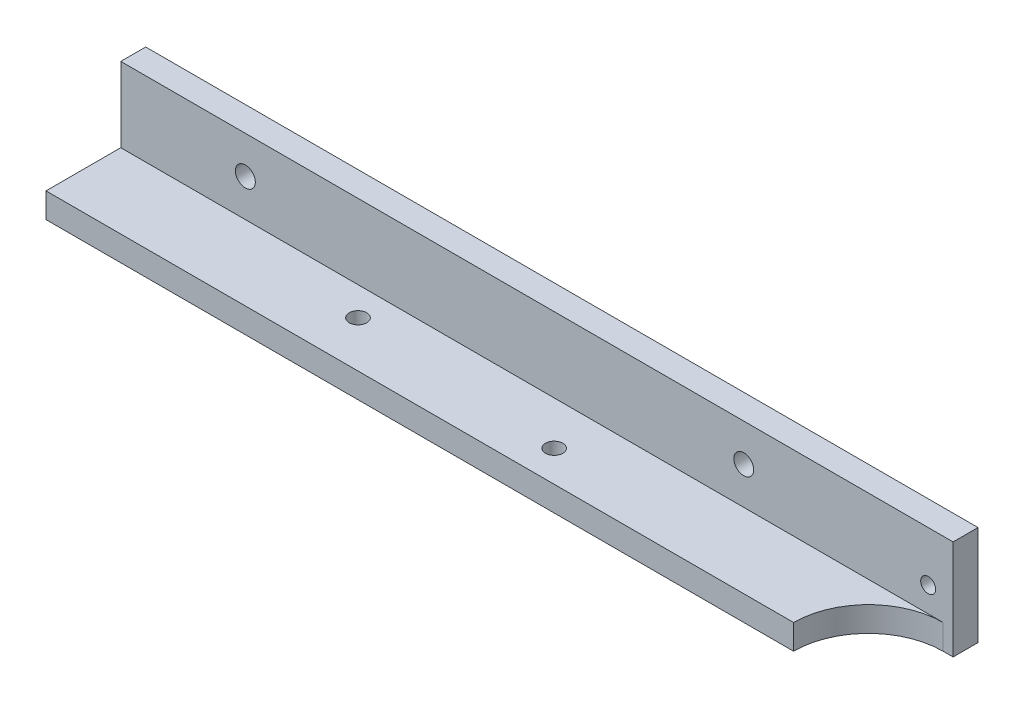
ISO-10303-21;
HEADER;
FILE_DESCRIPTION(('STEP AP214'),'2;1');
FILE_NAME('part.step','',(''),(''),'','','');
FILE_SCHEMA(('AUTOMOTIVE_DESIGN { 1 0 10303 214 1 1 1 1 }'));
ENDSEC;
DATA;
#1=APPLICATION_CONTEXT('core data for automotive mechanical design processes');
#2=APPLICATION_PROTOCOL_DEFINITION('international standard','automotive_design',2000,#1);
#3=PRODUCT_CONTEXT('',#1,'mechanical');
#4=PRODUCT('Part','Part','',(#3));
#5=PRODUCT_RELATED_PRODUCT_CATEGORY('part','',(#4));
#6=PRODUCT_DEFINITION_FORMATION('','',#4);
#7=PRODUCT_DEFINITION_CONTEXT('part definition',#1,'design');
#8=PRODUCT_DEFINITION('design','',#6,#7);
#9=PRODUCT_DEFINITION_SHAPE('','',#8);
#10=(LENGTH_UNIT() NAMED_UNIT(*) SI_UNIT(.MILLI.,.METRE.));
#11=(NAMED_UNIT(*) PLANE_ANGLE_UNIT() SI_UNIT($,.RADIAN.));
#12=(NAMED_UNIT(*) SI_UNIT($,.STERADIAN.) SOLID_ANGLE_UNIT());
#13=UNCERTAINTY_MEASURE_WITH_UNIT(LENGTH_MEASURE(1.E-05),#10,'distance_accuracy_value','');
#14=(GEOMETRIC_REPRESENTATION_CONTEXT(3) GLOBAL_UNCERTAINTY_ASSIGNED_CONTEXT((#13)) GLOBAL_UNIT_ASSIGNED_CONTEXT((#10,
#11,#12)) REPRESENTATION_CONTEXT('',''));
#15=CARTESIAN_POINT('',(0.,0.,0.));
#16=DIRECTION('',(0.,0.,1.));
#17=DIRECTION('',(1.,0.,0.));
#18=AXIS2_PLACEMENT_3D('',#15,#16,#17);
#19=CARTESIAN_POINT('',(0.,0.,0.));
#20=DIRECTION('',(0.,-1.,0.));
#21=DIRECTION('',(0.,0.,-1.));
#22=AXIS2_PLACEMENT_3D('',#19,#20,#21);
#23=PLANE('',#22);
#24=CARTESIAN_POINT('',(53.35,0.,-9.25));
#25=DIRECTION('',(0.,1.,0.));
#26=DIRECTION('',(0.,0.,1.));
#27=AXIS2_PLACEMENT_3D('',#24,#25,#26);
#28=CIRCLE('',#27,1.75);
#29=CARTESIAN_POINT('',(53.35,0.,-7.5));
#30=VERTEX_POINT('',#29);
#31=EDGE_CURVE('E133',#30,#30,#28,.T.);
#32=ORIENTED_EDGE('',*,*,#31,.F.);
#33=EDGE_LOOP('',(#32));
#34=FACE_BOUND('',#33,.T.);
#35=CARTESIAN_POINT('',(95.7,0.,-6.25));
#36=DIRECTION('',(0.,1.,0.));
#37=DIRECTION('',(0.,0.,1.));
#38=AXIS2_PLACEMENT_3D('',#35,#36,#37);
#39=CIRCLE('',#38,1.75);
#40=CARTESIAN_POINT('',(95.7,0.,-4.5));
#41=VERTEX_POINT('',#40);
#42=EDGE_CURVE('E121',#41,#41,#39,.T.);
#43=ORIENTED_EDGE('',*,*,#42,.F.);
#44=EDGE_LOOP('',(#43));
#45=FACE_BOUND('',#44,.T.);
#46=DIRECTION('',(1.,0.,0.));
#47=VECTOR('',#46,1.);
#48=CARTESIAN_POINT('',(0.,0.,-15.));
#49=LINE('',#48,#47);
#50=CARTESIAN_POINT('',(0.,0.,-15.));
#51=VERTEX_POINT('',#50);
#52=CARTESIAN_POINT('',(165.,0.,-15.));
#53=VERTEX_POINT('',#52);
#54=EDGE_CURVE('E55',#51,#53,#49,.T.);
#55=ORIENTED_EDGE('',*,*,#54,.F.);
#56=DIRECTION('',(0.,0.,1.));
#57=VECTOR('',#56,1.);
#58=CARTESIAN_POINT('',(0.,0.,0.));
#59=LINE('',#58,#57);
#60=CARTESIAN_POINT('',(0.,0.,0.));
#61=VERTEX_POINT('',#60);
#62=EDGE_CURVE('E160',#51,#61,#59,.T.);
#63=ORIENTED_EDGE('',*,*,#62,.T.);
#64=DIRECTION('',(1.,0.,0.));
#65=VECTOR('',#64,1.);
#66=CARTESIAN_POINT('',(0.,0.,0.));
#67=LINE('',#66,#65);
#68=CARTESIAN_POINT('',(150.,0.,0.));
#69=VERTEX_POINT('',#68);
#70=EDGE_CURVE('E165',#61,#69,#67,.T.);
#71=ORIENTED_EDGE('',*,*,#70,.T.);
#72=CARTESIAN_POINT('',(165.,0.,0.));
#73=DIRECTION('',(0.,-1.,0.));
#74=DIRECTION('',(0.,0.,-1.));
#75=AXIS2_PLACEMENT_3D('',#72,#73,#74);
#76=CIRCLE('',#75,15.);
#77=EDGE_CURVE('E11',#69,#53,#76,.T.);
#78=ORIENTED_EDGE('',*,*,#77,.T.);
#79=EDGE_LOOP('',(#55,#63,#71,#78));
#80=FACE_BOUND('',#79,.T.);
#81=ADVANCED_FACE('F40',(#34,#45,#80),#23,.F.);
#82=CARTESIAN_POINT('',(0.,-5.,0.));
#83=DIRECTION('',(-1.,0.,0.));
#84=DIRECTION('',(0.,0.,1.));
#85=AXIS2_PLACEMENT_3D('',#82,#83,#84);
#86=PLANE('',#85);
#87=ORIENTED_EDGE('',*,*,#62,.F.);
#88=DIRECTION('',(0.,-1.,0.));
#89=VECTOR('',#88,1.);
#90=CARTESIAN_POINT('',(0.,15.,-15.));
#91=LINE('',#90,#89);
#92=CARTESIAN_POINT('',(0.,15.,-15.));
#93=VERTEX_POINT('',#92);
#94=EDGE_CURVE('E157',#93,#51,#91,.T.);
#95=ORIENTED_EDGE('',*,*,#94,.F.);
#96=DIRECTION('',(0.,0.,1.));
#97=VECTOR('',#96,1.);
#98=CARTESIAN_POINT('',(0.,15.,-20.));
#99=LINE('',#98,#97);
#100=CARTESIAN_POINT('',(0.,15.,-20.));
#101=VERTEX_POINT('',#100);
#102=EDGE_CURVE('E149',#101,#93,#99,.T.);
#103=ORIENTED_EDGE('',*,*,#102,.F.);
#104=DIRECTION('',(0.,1.,0.));
#105=VECTOR('',#104,1.);
#106=CARTESIAN_POINT('',(0.,-5.,-20.));
#107=LINE('',#106,#105);
#108=CARTESIAN_POINT('',(0.,-5.,-20.));
#109=VERTEX_POINT('',#108);
#110=EDGE_CURVE('E173',#109,#101,#107,.T.);
#111=ORIENTED_EDGE('',*,*,#110,.F.);
#112=DIRECTION('',(0.,0.,1.));
#113=VECTOR('',#112,1.);
#114=CARTESIAN_POINT('',(0.,-5.,0.));
#115=LINE('',#114,#113);
#116=CARTESIAN_POINT('',(0.,-5.,0.));
#117=VERTEX_POINT('',#116);
#118=EDGE_CURVE('E161',#109,#117,#115,.T.);
#119=ORIENTED_EDGE('',*,*,#118,.T.);
#120=DIRECTION('',(0.,1.,0.));
#121=VECTOR('',#120,1.);
#122=CARTESIAN_POINT('',(0.,-5.,0.));
#123=LINE('',#122,#121);
#124=EDGE_CURVE('E169',#117,#61,#123,.T.);
#125=ORIENTED_EDGE('',*,*,#124,.T.);
#126=EDGE_LOOP('',(#87,#95,#103,#111,#119,#125));
#127=FACE_BOUND('',#126,.T.);
#128=ADVANCED_FACE('F188',(#127),#86,.T.);
#129=CARTESIAN_POINT('',(0.,-5.,-20.));
#130=DIRECTION('',(0.,0.,-1.));
#131=DIRECTION('',(-1.,0.,0.));
#132=AXIS2_PLACEMENT_3D('',#129,#130,#131);
#133=PLANE('',#132);
#134=CARTESIAN_POINT('',(162.,5.,-20.));
#135=DIRECTION('',(0.,0.,1.));
#136=DIRECTION('',(1.,0.,0.));
#137=AXIS2_PLACEMENT_3D('',#134,#135,#136);
#138=CIRCLE('',#137,1.5);
#139=CARTESIAN_POINT('',(163.5,5.,-20.));
#140=VERTEX_POINT('',#139);
#141=EDGE_CURVE('E117',#140,#140,#138,.T.);
#142=ORIENTED_EDGE('',*,*,#141,.T.);
#143=EDGE_LOOP('',(#142));
#144=FACE_BOUND('',#143,.T.);
#145=CARTESIAN_POINT('',(25.,7.5,-20.));
#146=DIRECTION('',(0.,0.,1.));
#147=DIRECTION('',(1.,0.,0.));
#148=AXIS2_PLACEMENT_3D('',#145,#146,#147);
#149=CIRCLE('',#148,2.);
#150=CARTESIAN_POINT('',(27.,7.5,-20.));
#151=VERTEX_POINT('',#150);
#152=EDGE_CURVE('E138',#151,#151,#149,.T.);
#153=ORIENTED_EDGE('',*,*,#152,.T.);
#154=EDGE_LOOP('',(#153));
#155=FACE_BOUND('',#154,.T.);
#156=CARTESIAN_POINT('',(125.,7.5,-20.));
#157=DIRECTION('',(0.,0.,1.));
#158=DIRECTION('',(1.,0.,0.));
#159=AXIS2_PLACEMENT_3D('',#156,#157,#158);
#160=CIRCLE('',#159,2.);
#161=CARTESIAN_POINT('',(127.,7.5,-20.));
#162=VERTEX_POINT('',#161);
#163=EDGE_CURVE('E144',#162,#162,#160,.T.);
#164=ORIENTED_EDGE('',*,*,#163,.T.);
#165=EDGE_LOOP('',(#164));
#166=FACE_BOUND('',#165,.T.);
#167=ORIENTED_EDGE('',*,*,#110,.T.);
#168=DIRECTION('',(-1.,0.,0.));
#169=VECTOR('',#168,1.);
#170=CARTESIAN_POINT('',(0.,15.,-20.));
#171=LINE('',#170,#169);
#172=CARTESIAN_POINT('',(167.,15.,-20.));
#173=VERTEX_POINT('',#172);
#174=EDGE_CURVE('E154',#173,#101,#171,.T.);
#175=ORIENTED_EDGE('',*,*,#174,.F.);
#176=DIRECTION('',(0.,1.,0.));
#177=VECTOR('',#176,1.);
#178=CARTESIAN_POINT('',(167.,15.,-20.));
#179=LINE('',#178,#177);
#180=CARTESIAN_POINT('',(167.,-5.,-20.));
#181=VERTEX_POINT('',#180);
#182=EDGE_CURVE('E109',#181,#173,#179,.T.);
#183=ORIENTED_EDGE('',*,*,#182,.F.);
#184=DIRECTION('',(-1.,0.,0.));
#185=VECTOR('',#184,1.);
#186=CARTESIAN_POINT('',(0.,-5.,-20.));
#187=LINE('',#186,#185);
#188=EDGE_CURVE('E105',#181,#109,#187,.T.);
#189=ORIENTED_EDGE('',*,*,#188,.T.);
#190=EDGE_LOOP('',(#167,#175,#183,#189));
#191=FACE_BOUND('',#190,.T.);
#192=ADVANCED_FACE('F191',(#144,#155,#166,#191),#133,.T.);
#193=CARTESIAN_POINT('',(0.,-5.,0.));
#194=DIRECTION('',(0.,0.,1.));
#195=DIRECTION('',(1.,0.,0.));
#196=AXIS2_PLACEMENT_3D('',#193,#194,#195);
#197=PLANE('',#196);
#198=ORIENTED_EDGE('',*,*,#70,.F.);
#199=ORIENTED_EDGE('',*,*,#124,.F.);
#200=DIRECTION('',(1.,0.,0.));
#201=VECTOR('',#200,1.);
#202=CARTESIAN_POINT('',(0.,-5.,0.));
#203=LINE('',#202,#201);
#204=CARTESIAN_POINT('',(150.,-5.,0.));
#205=VERTEX_POINT('',#204);
#206=EDGE_CURVE('E164',#117,#205,#203,.T.);
#207=ORIENTED_EDGE('',*,*,#206,.T.);
#208=DIRECTION('',(0.,1.,0.));
#209=VECTOR('',#208,1.);
#210=CARTESIAN_POINT('',(150.,-5.,0.));
#211=LINE('',#210,#209);
#212=EDGE_CURVE('E175',#205,#69,#211,.T.);
#213=ORIENTED_EDGE('',*,*,#212,.T.);
#214=EDGE_LOOP('',(#198,#199,#207,#213));
#215=FACE_BOUND('',#214,.T.);
#216=ADVANCED_FACE('F182',(#215),#197,.T.);
#217=CARTESIAN_POINT('',(0.,-5.,0.));
#218=DIRECTION('',(0.,-1.,0.));
#219=DIRECTION('',(0.,0.,-1.));
#220=AXIS2_PLACEMENT_3D('',#217,#218,#219);
#221=PLANE('',#220);
#222=CARTESIAN_POINT('',(53.35,-5.,-9.25));
#223=DIRECTION('',(0.,1.,0.));
#224=DIRECTION('',(0.,0.,1.));
#225=AXIS2_PLACEMENT_3D('',#222,#223,#224);
#226=CIRCLE('',#225,1.75);
#227=CARTESIAN_POINT('',(53.35,-5.,-7.5));
#228=VERTEX_POINT('',#227);
#229=EDGE_CURVE('E129',#228,#228,#226,.T.);
#230=ORIENTED_EDGE('',*,*,#229,.T.);
#231=EDGE_LOOP('',(#230));
#232=FACE_BOUND('',#231,.T.);
#233=CARTESIAN_POINT('',(95.7,-5.,-6.25));
#234=DIRECTION('',(0.,1.,0.));
#235=DIRECTION('',(0.,0.,1.));
#236=AXIS2_PLACEMENT_3D('',#233,#234,#235);
#237=CIRCLE('',#236,1.75);
#238=CARTESIAN_POINT('',(95.7,-5.,-4.5));
#239=VERTEX_POINT('',#238);
#240=EDGE_CURVE('E124',#239,#239,#237,.T.);
#241=ORIENTED_EDGE('',*,*,#240,.T.);
#242=EDGE_LOOP('',(#241));
#243=FACE_BOUND('',#242,.T.);
#244=ORIENTED_EDGE('',*,*,#118,.F.);
#245=ORIENTED_EDGE('',*,*,#188,.F.);
#246=DIRECTION('',(0.,0.,-1.));
#247=VECTOR('',#246,1.);
#248=CARTESIAN_POINT('',(167.,-5.,-15.));
#249=LINE('',#248,#247);
#250=CARTESIAN_POINT('',(167.,-5.,-15.));
#251=VERTEX_POINT('',#250);
#252=EDGE_CURVE('E98',#251,#181,#249,.T.);
#253=ORIENTED_EDGE('',*,*,#252,.F.);
#254=DIRECTION('',(-1.,0.,0.));
#255=VECTOR('',#254,1.);
#256=CARTESIAN_POINT('',(167.,-5.,-15.));
#257=LINE('',#256,#255);
#258=CARTESIAN_POINT('',(165.,-5.,-15.));
#259=VERTEX_POINT('',#258);
#260=EDGE_CURVE('E103',#251,#259,#257,.T.);
#261=ORIENTED_EDGE('',*,*,#260,.T.);
#262=CARTESIAN_POINT('',(165.,-5.,0.));
#263=DIRECTION('',(0.,-1.,0.));
#264=DIRECTION('',(0.,0.,-1.));
#265=AXIS2_PLACEMENT_3D('',#262,#263,#264);
#266=CIRCLE('',#265,15.);
#267=EDGE_CURVE('E48',#259,#205,#266,.F.);
#268=ORIENTED_EDGE('',*,*,#267,.T.);
#269=ORIENTED_EDGE('',*,*,#206,.F.);
#270=EDGE_LOOP('',(#244,#245,#253,#261,#268,#269));
#271=FACE_BOUND('',#270,.T.);
#272=ADVANCED_FACE('F101',(#232,#243,#271),#221,.T.);
#273=CARTESIAN_POINT('',(0.,15.,-15.));
#274=DIRECTION('',(0.,0.,-1.));
#275=DIRECTION('',(-1.,0.,0.));
#276=AXIS2_PLACEMENT_3D('',#273,#274,#275);
#277=PLANE('',#276);
#278=CARTESIAN_POINT('',(162.,5.,-15.));
#279=DIRECTION('',(0.,0.,1.));
#280=DIRECTION('',(1.,0.,0.));
#281=AXIS2_PLACEMENT_3D('',#278,#279,#280);
#282=CIRCLE('',#281,1.5);
#283=CARTESIAN_POINT('',(163.5,5.,-15.));
#284=VERTEX_POINT('',#283);
#285=EDGE_CURVE('E193',#284,#284,#282,.T.);
#286=ORIENTED_EDGE('',*,*,#285,.F.);
#287=EDGE_LOOP('',(#286));
#288=FACE_BOUND('',#287,.T.);
#289=CARTESIAN_POINT('',(25.,7.5,-15.));
#290=DIRECTION('',(0.,0.,1.));
#291=DIRECTION('',(1.,0.,0.));
#292=AXIS2_PLACEMENT_3D('',#289,#290,#291);
#293=CIRCLE('',#292,2.);
#294=CARTESIAN_POINT('',(27.,7.5,-15.));
#295=VERTEX_POINT('',#294);
#296=EDGE_CURVE('E141',#295,#295,#293,.T.);
#297=ORIENTED_EDGE('',*,*,#296,.F.);
#298=EDGE_LOOP('',(#297));
#299=FACE_BOUND('',#298,.T.);
#300=CARTESIAN_POINT('',(125.,7.5,-15.));
#301=DIRECTION('',(0.,0.,1.));
#302=DIRECTION('',(1.,0.,0.));
#303=AXIS2_PLACEMENT_3D('',#300,#301,#302);
#304=CIRCLE('',#303,2.);
#305=CARTESIAN_POINT('',(127.,7.5,-15.));
#306=VERTEX_POINT('',#305);
#307=EDGE_CURVE('E132',#306,#306,#304,.T.);
#308=ORIENTED_EDGE('',*,*,#307,.F.);
#309=EDGE_LOOP('',(#308));
#310=FACE_BOUND('',#309,.T.);
#311=ORIENTED_EDGE('',*,*,#54,.T.);
#312=DIRECTION('',(0.,-1.,0.));
#313=VECTOR('',#312,1.);
#314=CARTESIAN_POINT('',(165.,15.,-15.));
#315=LINE('',#314,#313);
#316=EDGE_CURVE('E120',#53,#259,#315,.T.);
#317=ORIENTED_EDGE('',*,*,#316,.T.);
#318=ORIENTED_EDGE('',*,*,#260,.F.);
#319=DIRECTION('',(0.,-1.,0.));
#320=VECTOR('',#319,1.);
#321=CARTESIAN_POINT('',(167.,15.,-15.));
#322=LINE('',#321,#320);
#323=CARTESIAN_POINT('',(167.,15.,-15.));
#324=VERTEX_POINT('',#323);
#325=EDGE_CURVE('E110',#324,#251,#322,.T.);
#326=ORIENTED_EDGE('',*,*,#325,.F.);
#327=DIRECTION('',(1.,0.,0.));
#328=VECTOR('',#327,1.);
#329=CARTESIAN_POINT('',(0.,15.,-15.));
#330=LINE('',#329,#328);
#331=EDGE_CURVE('E152',#93,#324,#330,.T.);
#332=ORIENTED_EDGE('',*,*,#331,.F.);
#333=ORIENTED_EDGE('',*,*,#94,.T.);
#334=EDGE_LOOP('',(#311,#317,#318,#326,#332,#333));
#335=FACE_BOUND('',#334,.T.);
#336=ADVANCED_FACE('F119',(#288,#299,#310,#335),#277,.F.);
#337=CARTESIAN_POINT('',(0.,15.,0.));
#338=DIRECTION('',(0.,1.,0.));
#339=DIRECTION('',(0.,0.,1.));
#340=AXIS2_PLACEMENT_3D('',#337,#338,#339);
#341=PLANE('',#340);
#342=ORIENTED_EDGE('',*,*,#102,.T.);
#343=ORIENTED_EDGE('',*,*,#331,.T.);
#344=DIRECTION('',(0.,0.,1.));
#345=VECTOR('',#344,1.);
#346=CARTESIAN_POINT('',(167.,15.,-15.));
#347=LINE('',#346,#345);
#348=EDGE_CURVE('E116',#173,#324,#347,.T.);
#349=ORIENTED_EDGE('',*,*,#348,.F.);
#350=ORIENTED_EDGE('',*,*,#174,.T.);
#351=EDGE_LOOP('',(#342,#343,#349,#350));
#352=FACE_BOUND('',#351,.T.);
#353=ADVANCED_FACE('F209',(#352),#341,.T.);
#354=CARTESIAN_POINT('',(125.,7.5,-20.));
#355=DIRECTION('',(0.,0.,1.));
#356=DIRECTION('',(1.,0.,0.));
#357=AXIS2_PLACEMENT_3D('',#354,#355,#356);
#358=CYLINDRICAL_SURFACE('',#357,2.);
#359=ORIENTED_EDGE('',*,*,#163,.F.);
#360=EDGE_LOOP('',(#359));
#361=FACE_BOUND('',#360,.T.);
#362=ORIENTED_EDGE('',*,*,#307,.T.);
#363=EDGE_LOOP('',(#362));
#364=FACE_BOUND('',#363,.T.);
#365=ADVANCED_FACE('F215',(#361,#364),#358,.F.);
#366=CARTESIAN_POINT('',(25.,7.5,-20.));
#367=DIRECTION('',(0.,0.,1.));
#368=DIRECTION('',(1.,0.,0.));
#369=AXIS2_PLACEMENT_3D('',#366,#367,#368);
#370=CYLINDRICAL_SURFACE('',#369,2.);
#371=ORIENTED_EDGE('',*,*,#152,.F.);
#372=EDGE_LOOP('',(#371));
#373=FACE_BOUND('',#372,.T.);
#374=ORIENTED_EDGE('',*,*,#296,.T.);
#375=EDGE_LOOP('',(#374));
#376=FACE_BOUND('',#375,.T.);
#377=ADVANCED_FACE('F217',(#373,#376),#370,.F.);
#378=CARTESIAN_POINT('',(95.7,-5.,-6.25));
#379=DIRECTION('',(0.,1.,0.));
#380=DIRECTION('',(0.,0.,1.));
#381=AXIS2_PLACEMENT_3D('',#378,#379,#380);
#382=CYLINDRICAL_SURFACE('',#381,1.75);
#383=ORIENTED_EDGE('',*,*,#240,.F.);
#384=EDGE_LOOP('',(#383));
#385=FACE_BOUND('',#384,.T.);
#386=ORIENTED_EDGE('',*,*,#42,.T.);
#387=EDGE_LOOP('',(#386));
#388=FACE_BOUND('',#387,.T.);
#389=ADVANCED_FACE('F224',(#385,#388),#382,.F.);
#390=CARTESIAN_POINT('',(53.35,-5.,-9.25));
#391=DIRECTION('',(0.,1.,0.));
#392=DIRECTION('',(0.,0.,1.));
#393=AXIS2_PLACEMENT_3D('',#390,#391,#392);
#394=CYLINDRICAL_SURFACE('',#393,1.75);
#395=ORIENTED_EDGE('',*,*,#229,.F.);
#396=EDGE_LOOP('',(#395));
#397=FACE_BOUND('',#396,.T.);
#398=ORIENTED_EDGE('',*,*,#31,.T.);
#399=EDGE_LOOP('',(#398));
#400=FACE_BOUND('',#399,.T.);
#401=ADVANCED_FACE('F255',(#397,#400),#394,.F.);
#402=CARTESIAN_POINT('',(167.,0.,0.));
#403=DIRECTION('',(1.,0.,0.));
#404=DIRECTION('',(0.,0.,-1.));
#405=AXIS2_PLACEMENT_3D('',#402,#403,#404);
#406=PLANE('',#405);
#407=ORIENTED_EDGE('',*,*,#325,.T.);
#408=ORIENTED_EDGE('',*,*,#252,.T.);
#409=ORIENTED_EDGE('',*,*,#182,.T.);
#410=ORIENTED_EDGE('',*,*,#348,.T.);
#411=EDGE_LOOP('',(#407,#408,#409,#410));
#412=FACE_BOUND('',#411,.T.);
#413=ADVANCED_FACE('F114',(#412),#406,.T.);
#414=CARTESIAN_POINT('',(162.,5.,-20.));
#415=DIRECTION('',(0.,0.,1.));
#416=DIRECTION('',(1.,0.,0.));
#417=AXIS2_PLACEMENT_3D('',#414,#415,#416);
#418=CYLINDRICAL_SURFACE('',#417,1.5);
#419=ORIENTED_EDGE('',*,*,#141,.F.);
#420=EDGE_LOOP('',(#419));
#421=FACE_BOUND('',#420,.T.);
#422=ORIENTED_EDGE('',*,*,#285,.T.);
#423=EDGE_LOOP('',(#422));
#424=FACE_BOUND('',#423,.T.);
#425=ADVANCED_FACE('F201',(#421,#424),#418,.F.);
#426=CARTESIAN_POINT('',(165.,15.,0.));
#427=DIRECTION('',(0.,-1.,0.));
#428=DIRECTION('',(0.,0.,-1.));
#429=AXIS2_PLACEMENT_3D('',#426,#427,#428);
#430=CYLINDRICAL_SURFACE('',#429,15.);
#431=ORIENTED_EDGE('',*,*,#77,.F.);
#432=ORIENTED_EDGE('',*,*,#212,.F.);
#433=ORIENTED_EDGE('',*,*,#267,.F.);
#434=ORIENTED_EDGE('',*,*,#316,.F.);
#435=EDGE_LOOP('',(#431,#432,#433,#434));
#436=FACE_BOUND('',#435,.T.);
#437=ADVANCED_FACE('F42',(#436),#430,.F.);
#438=CLOSED_SHELL('',(#81,#128,#192,#216,#272,#336,#353,#365,#377,#389,#401,#413,#425,#437));
#439=MANIFOLD_SOLID_BREP('B2',#438);
#440=ADVANCED_BREP_SHAPE_REPRESENTATION('',(#18,#439),#14);
#441=SHAPE_DEFINITION_REPRESENTATION(#9,#440);
ENDSEC;
END-ISO-10303-21;
